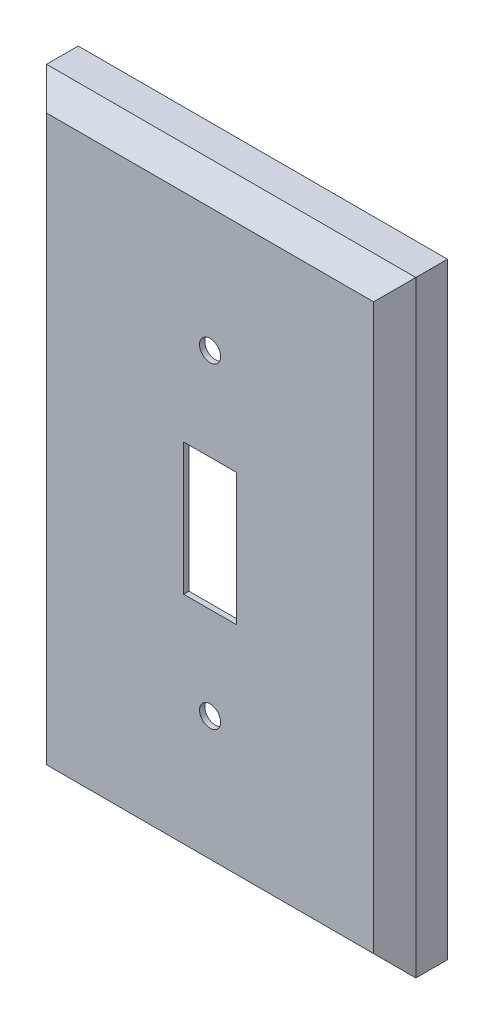
ISO-10303-21;
HEADER;
FILE_DESCRIPTION(('STEP AP214'),'2;1');
FILE_NAME('part.step','',(''),(''),'','','');
FILE_SCHEMA(('AUTOMOTIVE_DESIGN { 1 0 10303 214 1 1 1 1 }'));
ENDSEC;
DATA;
#1=APPLICATION_CONTEXT('core data for automotive mechanical design processes');
#2=APPLICATION_PROTOCOL_DEFINITION('international standard','automotive_design',2000,#1);
#3=PRODUCT_CONTEXT('',#1,'mechanical');
#4=PRODUCT('Part','Part','',(#3));
#5=PRODUCT_RELATED_PRODUCT_CATEGORY('part','',(#4));
#6=PRODUCT_DEFINITION_FORMATION('','',#4);
#7=PRODUCT_DEFINITION_CONTEXT('part definition',#1,'design');
#8=PRODUCT_DEFINITION('design','',#6,#7);
#9=PRODUCT_DEFINITION_SHAPE('','',#8);
#10=(LENGTH_UNIT() NAMED_UNIT(*) SI_UNIT(.MILLI.,.METRE.));
#11=(NAMED_UNIT(*) PLANE_ANGLE_UNIT() SI_UNIT($,.RADIAN.));
#12=(NAMED_UNIT(*) SI_UNIT($,.STERADIAN.) SOLID_ANGLE_UNIT());
#13=UNCERTAINTY_MEASURE_WITH_UNIT(LENGTH_MEASURE(1.E-05),#10,'distance_accuracy_value','');
#14=(GEOMETRIC_REPRESENTATION_CONTEXT(3) GLOBAL_UNCERTAINTY_ASSIGNED_CONTEXT((#13)) GLOBAL_UNIT_ASSIGNED_CONTEXT((#10,
#11,#12)) REPRESENTATION_CONTEXT('',''));
#15=CARTESIAN_POINT('',(0.,0.,0.));
#16=DIRECTION('',(0.,0.,1.));
#17=DIRECTION('',(1.,0.,0.));
#18=AXIS2_PLACEMENT_3D('',#15,#16,#17);
#19=CARTESIAN_POINT('',(0.,115.,0.));
#20=DIRECTION('',(0.,0.,-1.));
#21=DIRECTION('',(-1.,0.,0.));
#22=AXIS2_PLACEMENT_3D('',#19,#20,#21);
#23=PLANE('',#22);
#24=DIRECTION('',(0.,-1.,0.));
#25=VECTOR('',#24,1.);
#26=CARTESIAN_POINT('',(0.,0.,0.));
#27=LINE('',#26,#25);
#28=CARTESIAN_POINT('',(0.,115.,0.));
#29=VERTEX_POINT('',#28);
#30=CARTESIAN_POINT('',(0.,0.,0.));
#31=VERTEX_POINT('',#30);
#32=EDGE_CURVE('E243',#29,#31,#27,.T.);
#33=ORIENTED_EDGE('',*,*,#32,.F.);
#34=DIRECTION('',(-1.,0.,0.));
#35=VECTOR('',#34,1.);
#36=CARTESIAN_POINT('',(0.,115.,0.));
#37=LINE('',#36,#35);
#38=CARTESIAN_POINT('',(70.,115.,0.));
#39=VERTEX_POINT('',#38);
#40=EDGE_CURVE('E252',#39,#29,#37,.T.);
#41=ORIENTED_EDGE('',*,*,#40,.F.);
#42=DIRECTION('',(0.,1.,0.));
#43=VECTOR('',#42,1.);
#44=CARTESIAN_POINT('',(70.,0.,0.));
#45=LINE('',#44,#43);
#46=CARTESIAN_POINT('',(70.,0.,0.));
#47=VERTEX_POINT('',#46);
#48=EDGE_CURVE('E249',#47,#39,#45,.T.);
#49=ORIENTED_EDGE('',*,*,#48,.F.);
#50=DIRECTION('',(1.,0.,0.));
#51=VECTOR('',#50,1.);
#52=CARTESIAN_POINT('',(0.,0.,0.));
#53=LINE('',#52,#51);
#54=EDGE_CURVE('E246',#31,#47,#53,.T.);
#55=ORIENTED_EDGE('',*,*,#54,.F.);
#56=EDGE_LOOP('',(#33,#41,#49,#55));
#57=FACE_BOUND('',#56,.T.);
#58=DIRECTION('',(-1.,0.,0.));
#59=VECTOR('',#58,1.);
#60=CARTESIAN_POINT('',(0.,114.,0.));
#61=LINE('',#60,#59);
#62=CARTESIAN_POINT('',(69.,114.,0.));
#63=VERTEX_POINT('',#62);
#64=CARTESIAN_POINT('',(1.,114.,0.));
#65=VERTEX_POINT('',#64);
#66=EDGE_CURVE('E196',#63,#65,#61,.T.);
#67=ORIENTED_EDGE('',*,*,#66,.T.);
#68=DIRECTION('',(0.,-1.,0.));
#69=VECTOR('',#68,1.);
#70=CARTESIAN_POINT('',(1.,115.,0.));
#71=LINE('',#70,#69);
#72=CARTESIAN_POINT('',(1.,1.,0.));
#73=VERTEX_POINT('',#72);
#74=EDGE_CURVE('E210',#65,#73,#71,.T.);
#75=ORIENTED_EDGE('',*,*,#74,.T.);
#76=DIRECTION('',(1.,0.,0.));
#77=VECTOR('',#76,1.);
#78=CARTESIAN_POINT('',(0.,1.,0.));
#79=LINE('',#78,#77);
#80=CARTESIAN_POINT('',(69.,1.,0.));
#81=VERTEX_POINT('',#80);
#82=EDGE_CURVE('E226',#73,#81,#79,.T.);
#83=ORIENTED_EDGE('',*,*,#82,.T.);
#84=DIRECTION('',(0.,1.,0.));
#85=VECTOR('',#84,1.);
#86=CARTESIAN_POINT('',(69.,115.,0.));
#87=LINE('',#86,#85);
#88=EDGE_CURVE('E229',#81,#63,#87,.T.);
#89=ORIENTED_EDGE('',*,*,#88,.T.);
#90=EDGE_LOOP('',(#67,#75,#83,#89));
#91=FACE_BOUND('',#90,.T.);
#92=ADVANCED_FACE('F42',(#57,#91),#23,.T.);
#93=CARTESIAN_POINT('',(0.,0.,10.));
#94=DIRECTION('',(1.,0.,0.));
#95=DIRECTION('',(0.,0.,-1.));
#96=AXIS2_PLACEMENT_3D('',#93,#94,#95);
#97=PLANE('',#96);
#98=DIRECTION('',(0.,0.,-1.));
#99=VECTOR('',#98,1.);
#100=CARTESIAN_POINT('',(0.,0.,10.));
#101=LINE('',#100,#99);
#102=CARTESIAN_POINT('',(0.,0.,6.));
#103=VERTEX_POINT('',#102);
#104=EDGE_CURVE('E261',#103,#31,#101,.T.);
#105=ORIENTED_EDGE('',*,*,#104,.F.);
#106=DIRECTION('',(0.,1.,0.));
#107=VECTOR('',#106,1.);
#108=CARTESIAN_POINT('',(0.,0.,6.));
#109=LINE('',#108,#107);
#110=CARTESIAN_POINT('',(0.,115.,6.));
#111=VERTEX_POINT('',#110);
#112=EDGE_CURVE('E279',#103,#111,#109,.T.);
#113=ORIENTED_EDGE('',*,*,#112,.T.);
#114=DIRECTION('',(0.,0.,-1.));
#115=VECTOR('',#114,1.);
#116=CARTESIAN_POINT('',(0.,115.,10.));
#117=LINE('',#116,#115);
#118=EDGE_CURVE('E255',#111,#29,#117,.T.);
#119=ORIENTED_EDGE('',*,*,#118,.T.);
#120=ORIENTED_EDGE('',*,*,#32,.T.);
#121=EDGE_LOOP('',(#105,#113,#119,#120));
#122=FACE_BOUND('',#121,.T.);
#123=ADVANCED_FACE('F44',(#122),#97,.F.);
#124=CARTESIAN_POINT('',(0.,0.,10.));
#125=DIRECTION('',(0.,1.,0.));
#126=DIRECTION('',(0.,0.,1.));
#127=AXIS2_PLACEMENT_3D('',#124,#125,#126);
#128=PLANE('',#127);
#129=DIRECTION('',(0.,0.,-1.));
#130=VECTOR('',#129,1.);
#131=CARTESIAN_POINT('',(70.,0.,10.));
#132=LINE('',#131,#130);
#133=CARTESIAN_POINT('',(70.,0.,6.));
#134=VERTEX_POINT('',#133);
#135=EDGE_CURVE('E259',#134,#47,#132,.T.);
#136=ORIENTED_EDGE('',*,*,#135,.F.);
#137=DIRECTION('',(-1.,0.,0.));
#138=VECTOR('',#137,1.);
#139=CARTESIAN_POINT('',(0.,0.,6.));
#140=LINE('',#139,#138);
#141=EDGE_CURVE('E277',#134,#103,#140,.T.);
#142=ORIENTED_EDGE('',*,*,#141,.T.);
#143=ORIENTED_EDGE('',*,*,#104,.T.);
#144=ORIENTED_EDGE('',*,*,#54,.T.);
#145=EDGE_LOOP('',(#136,#142,#143,#144));
#146=FACE_BOUND('',#145,.T.);
#147=ADVANCED_FACE('F322',(#146),#128,.F.);
#148=CARTESIAN_POINT('',(70.,0.,10.));
#149=DIRECTION('',(-1.,0.,0.));
#150=DIRECTION('',(0.,0.,1.));
#151=AXIS2_PLACEMENT_3D('',#148,#149,#150);
#152=PLANE('',#151);
#153=DIRECTION('',(0.,0.,-1.));
#154=VECTOR('',#153,1.);
#155=CARTESIAN_POINT('',(70.,115.,10.));
#156=LINE('',#155,#154);
#157=CARTESIAN_POINT('',(70.,115.,6.));
#158=VERTEX_POINT('',#157);
#159=EDGE_CURVE('E257',#158,#39,#156,.T.);
#160=ORIENTED_EDGE('',*,*,#159,.F.);
#161=DIRECTION('',(0.,-1.,0.));
#162=VECTOR('',#161,1.);
#163=CARTESIAN_POINT('',(70.,0.,6.));
#164=LINE('',#163,#162);
#165=EDGE_CURVE('E275',#158,#134,#164,.T.);
#166=ORIENTED_EDGE('',*,*,#165,.T.);
#167=ORIENTED_EDGE('',*,*,#135,.T.);
#168=ORIENTED_EDGE('',*,*,#48,.T.);
#169=EDGE_LOOP('',(#160,#166,#167,#168));
#170=FACE_BOUND('',#169,.T.);
#171=ADVANCED_FACE('F313',(#170),#152,.F.);
#172=CARTESIAN_POINT('',(0.,115.,10.));
#173=DIRECTION('',(0.,-1.,0.));
#174=DIRECTION('',(0.,0.,-1.));
#175=AXIS2_PLACEMENT_3D('',#172,#173,#174);
#176=PLANE('',#175);
#177=ORIENTED_EDGE('',*,*,#118,.F.);
#178=DIRECTION('',(1.,0.,0.));
#179=VECTOR('',#178,1.);
#180=CARTESIAN_POINT('',(0.,115.,6.));
#181=LINE('',#180,#179);
#182=EDGE_CURVE('E272',#111,#158,#181,.T.);
#183=ORIENTED_EDGE('',*,*,#182,.T.);
#184=ORIENTED_EDGE('',*,*,#159,.T.);
#185=ORIENTED_EDGE('',*,*,#40,.T.);
#186=EDGE_LOOP('',(#177,#183,#184,#185));
#187=FACE_BOUND('',#186,.T.);
#188=ADVANCED_FACE('F304',(#187),#176,.F.);
#189=CARTESIAN_POINT('',(0.,115.,10.));
#190=DIRECTION('',(0.,0.,-1.));
#191=DIRECTION('',(-1.,0.,0.));
#192=AXIS2_PLACEMENT_3D('',#189,#190,#191);
#193=PLANE('',#192);
#194=CARTESIAN_POINT('',(35.,27.5,10.));
#195=DIRECTION('',(0.,0.,1.));
#196=DIRECTION('',(-1.,0.,0.));
#197=AXIS2_PLACEMENT_3D('',#194,#195,#196);
#198=CIRCLE('',#197,2.);
#199=CARTESIAN_POINT('',(33.,27.5,10.));
#200=VERTEX_POINT('',#199);
#201=EDGE_CURVE('E294',#200,#200,#198,.T.);
#202=ORIENTED_EDGE('',*,*,#201,.F.);
#203=EDGE_LOOP('',(#202));
#204=FACE_BOUND('',#203,.T.);
#205=CARTESIAN_POINT('',(35.,87.5,10.));
#206=DIRECTION('',(0.,0.,1.));
#207=DIRECTION('',(1.,0.,0.));
#208=AXIS2_PLACEMENT_3D('',#205,#206,#207);
#209=CIRCLE('',#208,2.);
#210=CARTESIAN_POINT('',(37.,87.5,10.));
#211=VERTEX_POINT('',#210);
#212=EDGE_CURVE('E286',#211,#211,#209,.T.);
#213=ORIENTED_EDGE('',*,*,#212,.F.);
#214=EDGE_LOOP('',(#213));
#215=FACE_BOUND('',#214,.T.);
#216=DIRECTION('',(1.,0.,0.));
#217=VECTOR('',#216,1.);
#218=CARTESIAN_POINT('',(30.,45.,10.));
#219=LINE('',#218,#217);
#220=CARTESIAN_POINT('',(30.,45.,10.));
#221=VERTEX_POINT('',#220);
#222=CARTESIAN_POINT('',(40.,45.,10.));
#223=VERTEX_POINT('',#222);
#224=EDGE_CURVE('E168',#221,#223,#219,.T.);
#225=ORIENTED_EDGE('',*,*,#224,.F.);
#226=DIRECTION('',(0.,-1.,0.));
#227=VECTOR('',#226,1.);
#228=CARTESIAN_POINT('',(30.,70.,10.));
#229=LINE('',#228,#227);
#230=CARTESIAN_POINT('',(30.,70.,10.));
#231=VERTEX_POINT('',#230);
#232=EDGE_CURVE('E59',#231,#221,#229,.T.);
#233=ORIENTED_EDGE('',*,*,#232,.F.);
#234=DIRECTION('',(-1.,0.,0.));
#235=VECTOR('',#234,1.);
#236=CARTESIAN_POINT('',(30.,70.,10.));
#237=LINE('',#236,#235);
#238=CARTESIAN_POINT('',(40.,70.,10.));
#239=VERTEX_POINT('',#238);
#240=EDGE_CURVE('E175',#239,#231,#237,.T.);
#241=ORIENTED_EDGE('',*,*,#240,.F.);
#242=DIRECTION('',(0.,1.,0.));
#243=VECTOR('',#242,1.);
#244=CARTESIAN_POINT('',(40.,70.,10.));
#245=LINE('',#244,#243);
#246=EDGE_CURVE('E159',#223,#239,#245,.T.);
#247=ORIENTED_EDGE('',*,*,#246,.F.);
#248=EDGE_LOOP('',(#225,#233,#241,#247));
#249=FACE_BOUND('',#248,.T.);
#250=DIRECTION('',(0.,1.,0.));
#251=VECTOR('',#250,1.);
#252=CARTESIAN_POINT('',(66.,115.,10.));
#253=LINE('',#252,#251);
#254=CARTESIAN_POINT('',(66.,4.,10.));
#255=VERTEX_POINT('',#254);
#256=CARTESIAN_POINT('',(66.,111.,10.));
#257=VERTEX_POINT('',#256);
#258=EDGE_CURVE('E267',#255,#257,#253,.T.);
#259=ORIENTED_EDGE('',*,*,#258,.T.);
#260=DIRECTION('',(-1.,0.,0.));
#261=VECTOR('',#260,1.);
#262=CARTESIAN_POINT('',(0.,111.,10.));
#263=LINE('',#262,#261);
#264=CARTESIAN_POINT('',(4.,111.,10.));
#265=VERTEX_POINT('',#264);
#266=EDGE_CURVE('E269',#257,#265,#263,.T.);
#267=ORIENTED_EDGE('',*,*,#266,.T.);
#268=DIRECTION('',(0.,-1.,0.));
#269=VECTOR('',#268,1.);
#270=CARTESIAN_POINT('',(4.,115.,10.));
#271=LINE('',#270,#269);
#272=CARTESIAN_POINT('',(4.,4.,10.));
#273=VERTEX_POINT('',#272);
#274=EDGE_CURVE('E263',#265,#273,#271,.T.);
#275=ORIENTED_EDGE('',*,*,#274,.T.);
#276=DIRECTION('',(1.,0.,0.));
#277=VECTOR('',#276,1.);
#278=CARTESIAN_POINT('',(0.,4.,10.));
#279=LINE('',#278,#277);
#280=EDGE_CURVE('E265',#273,#255,#279,.T.);
#281=ORIENTED_EDGE('',*,*,#280,.T.);
#282=EDGE_LOOP('',(#259,#267,#275,#281));
#283=FACE_BOUND('',#282,.T.);
#284=ADVANCED_FACE('F172',(#204,#215,#249,#283),#193,.F.);
#285=CARTESIAN_POINT('',(0.,4.,10.));
#286=DIRECTION('',(0.,0.707106781186547,-0.707106781186547));
#287=DIRECTION('',(0.,0.707106781186548,0.707106781186548));
#288=AXIS2_PLACEMENT_3D('',#285,#286,#287);
#289=PLANE('',#288);
#290=DIRECTION('',(0.577350269189626,0.577350269189626,0.577350269189626));
#291=VECTOR('',#290,1.);
#292=CARTESIAN_POINT('',(41.,41.,47.));
#293=LINE('',#292,#291);
#294=EDGE_CURVE('E237',#103,#273,#293,.T.);
#295=ORIENTED_EDGE('',*,*,#294,.F.);
#296=ORIENTED_EDGE('',*,*,#141,.F.);
#297=DIRECTION('',(-0.577350269189626,0.577350269189626,0.577350269189626));
#298=VECTOR('',#297,1.);
#299=CARTESIAN_POINT('',(44.,26.,32.));
#300=LINE('',#299,#298);
#301=EDGE_CURVE('E240',#255,#134,#300,.F.);
#302=ORIENTED_EDGE('',*,*,#301,.F.);
#303=ORIENTED_EDGE('',*,*,#280,.F.);
#304=EDGE_LOOP('',(#295,#296,#302,#303));
#305=FACE_BOUND('',#304,.T.);
#306=ADVANCED_FACE('F303',(#305),#289,.F.);
#307=CARTESIAN_POINT('',(66.,115.,10.));
#308=DIRECTION('',(-0.707106781186547,0.,-0.707106781186547));
#309=DIRECTION('',(-0.707106781186548,0.,0.707106781186548));
#310=AXIS2_PLACEMENT_3D('',#307,#308,#309);
#311=PLANE('',#310);
#312=ORIENTED_EDGE('',*,*,#301,.T.);
#313=ORIENTED_EDGE('',*,*,#165,.F.);
#314=DIRECTION('',(-0.577350269189626,-0.577350269189626,0.577350269189626));
#315=VECTOR('',#314,1.);
#316=CARTESIAN_POINT('',(67.3333333333333,112.333333333333,8.66666666666667));
#317=LINE('',#316,#315);
#318=EDGE_CURVE('E235',#257,#158,#317,.F.);
#319=ORIENTED_EDGE('',*,*,#318,.F.);
#320=ORIENTED_EDGE('',*,*,#258,.F.);
#321=EDGE_LOOP('',(#312,#313,#319,#320));
#322=FACE_BOUND('',#321,.T.);
#323=ADVANCED_FACE('F310',(#322),#311,.F.);
#324=CARTESIAN_POINT('',(4.,115.,10.));
#325=DIRECTION('',(0.707106781186547,0.,-0.707106781186547));
#326=DIRECTION('',(-0.707106781186548,0.,-0.707106781186548));
#327=AXIS2_PLACEMENT_3D('',#324,#325,#326);
#328=PLANE('',#327);
#329=ORIENTED_EDGE('',*,*,#294,.T.);
#330=ORIENTED_EDGE('',*,*,#274,.F.);
#331=DIRECTION('',(-0.577350269189626,0.577350269189626,-0.577350269189626));
#332=VECTOR('',#331,1.);
#333=CARTESIAN_POINT('',(2.66666666666667,112.333333333333,8.66666666666667));
#334=LINE('',#333,#332);
#335=EDGE_CURVE('E191',#111,#265,#334,.F.);
#336=ORIENTED_EDGE('',*,*,#335,.F.);
#337=ORIENTED_EDGE('',*,*,#112,.F.);
#338=EDGE_LOOP('',(#329,#330,#336,#337));
#339=FACE_BOUND('',#338,.T.);
#340=ADVANCED_FACE('F329',(#339),#328,.F.);
#341=CARTESIAN_POINT('',(0.,111.,10.));
#342=DIRECTION('',(0.,-0.707106781186547,-0.707106781186547));
#343=DIRECTION('',(0.,0.707106781186548,-0.707106781186548));
#344=AXIS2_PLACEMENT_3D('',#341,#342,#343);
#345=PLANE('',#344);
#346=ORIENTED_EDGE('',*,*,#318,.T.);
#347=ORIENTED_EDGE('',*,*,#182,.F.);
#348=ORIENTED_EDGE('',*,*,#335,.T.);
#349=ORIENTED_EDGE('',*,*,#266,.F.);
#350=EDGE_LOOP('',(#346,#347,#348,#349));
#351=FACE_BOUND('',#350,.T.);
#352=ADVANCED_FACE('F333',(#351),#345,.F.);
#353=CARTESIAN_POINT('',(1.,0.,10.));
#354=DIRECTION('',(1.,0.,0.));
#355=DIRECTION('',(0.,0.,-1.));
#356=AXIS2_PLACEMENT_3D('',#353,#354,#355);
#357=PLANE('',#356);
#358=DIRECTION('',(0.,0.,-1.));
#359=VECTOR('',#358,1.);
#360=CARTESIAN_POINT('',(1.,1.,10.));
#361=LINE('',#360,#359);
#362=CARTESIAN_POINT('',(1.,0.999999999999994,5.58578643762691));
#363=VERTEX_POINT('',#362);
#364=EDGE_CURVE('E185',#363,#73,#361,.T.);
#365=ORIENTED_EDGE('',*,*,#364,.T.);
#366=ORIENTED_EDGE('',*,*,#74,.F.);
#367=DIRECTION('',(0.,0.,-1.));
#368=VECTOR('',#367,1.);
#369=CARTESIAN_POINT('',(1.,114.,10.));
#370=LINE('',#369,#368);
#371=CARTESIAN_POINT('',(1.,114.,5.5857864376269));
#372=VERTEX_POINT('',#371);
#373=EDGE_CURVE('E193',#372,#65,#370,.T.);
#374=ORIENTED_EDGE('',*,*,#373,.F.);
#375=DIRECTION('',(0.,-1.,0.));
#376=VECTOR('',#375,1.);
#377=CARTESIAN_POINT('',(1.,115.,5.5857864376269));
#378=LINE('',#377,#376);
#379=EDGE_CURVE('E189',#363,#372,#378,.F.);
#380=ORIENTED_EDGE('',*,*,#379,.F.);
#381=EDGE_LOOP('',(#365,#366,#374,#380));
#382=FACE_BOUND('',#381,.T.);
#383=ADVANCED_FACE('F337',(#382),#357,.T.);
#384=CARTESIAN_POINT('',(0.,1.,10.));
#385=DIRECTION('',(0.,1.,0.));
#386=DIRECTION('',(0.,0.,1.));
#387=AXIS2_PLACEMENT_3D('',#384,#385,#386);
#388=PLANE('',#387);
#389=DIRECTION('',(0.,0.,-1.));
#390=VECTOR('',#389,1.);
#391=CARTESIAN_POINT('',(69.,1.,10.));
#392=LINE('',#391,#390);
#393=CARTESIAN_POINT('',(69.,0.999999999999994,5.5857864376269));
#394=VERTEX_POINT('',#393);
#395=EDGE_CURVE('E188',#394,#81,#392,.T.);
#396=ORIENTED_EDGE('',*,*,#395,.T.);
#397=ORIENTED_EDGE('',*,*,#82,.F.);
#398=ORIENTED_EDGE('',*,*,#364,.F.);
#399=DIRECTION('',(1.,0.,0.));
#400=VECTOR('',#399,1.);
#401=CARTESIAN_POINT('',(0.,1.,5.5857864376269));
#402=LINE('',#401,#400);
#403=EDGE_CURVE('E192',#394,#363,#402,.F.);
#404=ORIENTED_EDGE('',*,*,#403,.F.);
#405=EDGE_LOOP('',(#396,#397,#398,#404));
#406=FACE_BOUND('',#405,.T.);
#407=ADVANCED_FACE('F367',(#406),#388,.T.);
#408=CARTESIAN_POINT('',(69.,0.,10.));
#409=DIRECTION('',(-1.,0.,0.));
#410=DIRECTION('',(0.,0.,1.));
#411=AXIS2_PLACEMENT_3D('',#408,#409,#410);
#412=PLANE('',#411);
#413=DIRECTION('',(0.,0.,-1.));
#414=VECTOR('',#413,1.);
#415=CARTESIAN_POINT('',(69.,114.,10.));
#416=LINE('',#415,#414);
#417=CARTESIAN_POINT('',(69.,114.,5.5857864376269));
#418=VERTEX_POINT('',#417);
#419=EDGE_CURVE('E195',#418,#63,#416,.T.);
#420=ORIENTED_EDGE('',*,*,#419,.T.);
#421=ORIENTED_EDGE('',*,*,#88,.F.);
#422=ORIENTED_EDGE('',*,*,#395,.F.);
#423=DIRECTION('',(0.,1.,0.));
#424=VECTOR('',#423,1.);
#425=CARTESIAN_POINT('',(69.,115.,5.58578643762691));
#426=LINE('',#425,#424);
#427=EDGE_CURVE('E200',#418,#394,#426,.F.);
#428=ORIENTED_EDGE('',*,*,#427,.F.);
#429=EDGE_LOOP('',(#420,#421,#422,#428));
#430=FACE_BOUND('',#429,.T.);
#431=ADVANCED_FACE('F363',(#430),#412,.T.);
#432=CARTESIAN_POINT('',(0.,114.,10.));
#433=DIRECTION('',(0.,-1.,0.));
#434=DIRECTION('',(0.,0.,-1.));
#435=AXIS2_PLACEMENT_3D('',#432,#433,#434);
#436=PLANE('',#435);
#437=ORIENTED_EDGE('',*,*,#373,.T.);
#438=ORIENTED_EDGE('',*,*,#66,.F.);
#439=ORIENTED_EDGE('',*,*,#419,.F.);
#440=DIRECTION('',(-1.,0.,0.));
#441=VECTOR('',#440,1.);
#442=CARTESIAN_POINT('',(0.,114.,5.58578643762691));
#443=LINE('',#442,#441);
#444=EDGE_CURVE('E203',#372,#418,#443,.F.);
#445=ORIENTED_EDGE('',*,*,#444,.F.);
#446=EDGE_LOOP('',(#437,#438,#439,#445));
#447=FACE_BOUND('',#446,.T.);
#448=ADVANCED_FACE('F359',(#447),#436,.T.);
#449=CARTESIAN_POINT('',(0.,115.,9.));
#450=DIRECTION('',(0.,0.,-1.));
#451=DIRECTION('',(-1.,0.,0.));
#452=AXIS2_PLACEMENT_3D('',#449,#450,#451);
#453=PLANE('',#452);
#454=CARTESIAN_POINT('',(35.,27.5,9.));
#455=DIRECTION('',(0.,0.,-1.));
#456=DIRECTION('',(-1.,0.,0.));
#457=AXIS2_PLACEMENT_3D('',#454,#455,#456);
#458=CIRCLE('',#457,2.);
#459=CARTESIAN_POINT('',(33.,27.5,9.));
#460=VERTEX_POINT('',#459);
#461=EDGE_CURVE('E46',#460,#460,#458,.T.);
#462=ORIENTED_EDGE('',*,*,#461,.F.);
#463=EDGE_LOOP('',(#462));
#464=FACE_BOUND('',#463,.T.);
#465=CARTESIAN_POINT('',(35.,87.5,9.));
#466=DIRECTION('',(0.,0.,-1.));
#467=DIRECTION('',(-1.,0.,0.));
#468=AXIS2_PLACEMENT_3D('',#465,#466,#467);
#469=CIRCLE('',#468,2.);
#470=CARTESIAN_POINT('',(33.,87.5,9.));
#471=VERTEX_POINT('',#470);
#472=EDGE_CURVE('E284',#471,#471,#469,.T.);
#473=ORIENTED_EDGE('',*,*,#472,.F.);
#474=EDGE_LOOP('',(#473));
#475=FACE_BOUND('',#474,.T.);
#476=DIRECTION('',(0.,1.,0.));
#477=VECTOR('',#476,1.);
#478=CARTESIAN_POINT('',(30.,115.,9.));
#479=LINE('',#478,#477);
#480=CARTESIAN_POINT('',(30.,45.,9.));
#481=VERTEX_POINT('',#480);
#482=CARTESIAN_POINT('',(30.,70.,9.));
#483=VERTEX_POINT('',#482);
#484=EDGE_CURVE('E13',#481,#483,#479,.T.);
#485=ORIENTED_EDGE('',*,*,#484,.F.);
#486=DIRECTION('',(-1.,0.,0.));
#487=VECTOR('',#486,1.);
#488=CARTESIAN_POINT('',(0.,45.,9.));
#489=LINE('',#488,#487);
#490=CARTESIAN_POINT('',(40.,45.,9.));
#491=VERTEX_POINT('',#490);
#492=EDGE_CURVE('E281',#491,#481,#489,.T.);
#493=ORIENTED_EDGE('',*,*,#492,.F.);
#494=DIRECTION('',(0.,-1.,0.));
#495=VECTOR('',#494,1.);
#496=CARTESIAN_POINT('',(40.,115.,9.));
#497=LINE('',#496,#495);
#498=CARTESIAN_POINT('',(40.,70.,9.));
#499=VERTEX_POINT('',#498);
#500=EDGE_CURVE('E162',#499,#491,#497,.T.);
#501=ORIENTED_EDGE('',*,*,#500,.F.);
#502=DIRECTION('',(1.,0.,0.));
#503=VECTOR('',#502,1.);
#504=CARTESIAN_POINT('',(0.,70.,9.));
#505=LINE('',#504,#503);
#506=EDGE_CURVE('E51',#483,#499,#505,.T.);
#507=ORIENTED_EDGE('',*,*,#506,.F.);
#508=EDGE_LOOP('',(#485,#493,#501,#507));
#509=FACE_BOUND('',#508,.T.);
#510=DIRECTION('',(0.,-1.,0.));
#511=VECTOR('',#510,1.);
#512=CARTESIAN_POINT('',(65.5857864376269,115.,9.));
#513=LINE('',#512,#511);
#514=CARTESIAN_POINT('',(65.5857864376269,4.4142135623731,9.));
#515=VERTEX_POINT('',#514);
#516=CARTESIAN_POINT('',(65.5857864376269,110.585786437627,9.));
#517=VERTEX_POINT('',#516);
#518=EDGE_CURVE('E214',#515,#517,#513,.F.);
#519=ORIENTED_EDGE('',*,*,#518,.F.);
#520=DIRECTION('',(-1.,0.,0.));
#521=VECTOR('',#520,1.);
#522=CARTESIAN_POINT('',(0.,4.4142135623731,9.));
#523=LINE('',#522,#521);
#524=CARTESIAN_POINT('',(4.4142135623731,4.4142135623731,9.));
#525=VERTEX_POINT('',#524);
#526=EDGE_CURVE('E216',#525,#515,#523,.F.);
#527=ORIENTED_EDGE('',*,*,#526,.F.);
#528=DIRECTION('',(0.,1.,0.));
#529=VECTOR('',#528,1.);
#530=CARTESIAN_POINT('',(4.4142135623731,115.,9.));
#531=LINE('',#530,#529);
#532=CARTESIAN_POINT('',(4.4142135623731,110.585786437627,9.));
#533=VERTEX_POINT('',#532);
#534=EDGE_CURVE('E187',#533,#525,#531,.F.);
#535=ORIENTED_EDGE('',*,*,#534,.F.);
#536=DIRECTION('',(1.,0.,0.));
#537=VECTOR('',#536,1.);
#538=CARTESIAN_POINT('',(0.,110.585786437627,9.));
#539=LINE('',#538,#537);
#540=EDGE_CURVE('E206',#517,#533,#539,.F.);
#541=ORIENTED_EDGE('',*,*,#540,.F.);
#542=EDGE_LOOP('',(#519,#527,#535,#541));
#543=FACE_BOUND('',#542,.T.);
#544=ADVANCED_FACE('F355',(#464,#475,#509,#543),#453,.T.);
#545=CARTESIAN_POINT('',(0.,4.70710678118655,9.29289321881345));
#546=DIRECTION('',(0.,0.707106781186547,-0.707106781186547));
#547=DIRECTION('',(0.,0.707106781186548,0.707106781186548));
#548=AXIS2_PLACEMENT_3D('',#545,#546,#547);
#549=PLANE('',#548);
#550=DIRECTION('',(0.577350269189626,0.577350269189626,0.577350269189626));
#551=VECTOR('',#550,1.);
#552=CARTESIAN_POINT('',(41.471404520791,41.471404520791,46.0571909584179));
#553=LINE('',#552,#551);
#554=EDGE_CURVE('E211',#363,#525,#553,.T.);
#555=ORIENTED_EDGE('',*,*,#554,.T.);
#556=ORIENTED_EDGE('',*,*,#526,.T.);
#557=DIRECTION('',(0.577350269189626,-0.577350269189626,-0.577350269189626));
#558=VECTOR('',#557,1.);
#559=CARTESIAN_POINT('',(28.528595479209,41.471404520791,46.0571909584179));
#560=LINE('',#559,#558);
#561=EDGE_CURVE('E207',#515,#394,#560,.T.);
#562=ORIENTED_EDGE('',*,*,#561,.T.);
#563=ORIENTED_EDGE('',*,*,#403,.T.);
#564=EDGE_LOOP('',(#555,#556,#562,#563));
#565=FACE_BOUND('',#564,.T.);
#566=ADVANCED_FACE('F351',(#565),#549,.T.);
#567=CARTESIAN_POINT('',(65.2928932188135,115.,9.29289321881345));
#568=DIRECTION('',(-0.707106781186547,0.,-0.707106781186547));
#569=DIRECTION('',(-0.707106781186548,0.,0.707106781186548));
#570=AXIS2_PLACEMENT_3D('',#567,#568,#569);
#571=PLANE('',#570);
#572=ORIENTED_EDGE('',*,*,#561,.F.);
#573=ORIENTED_EDGE('',*,*,#518,.T.);
#574=DIRECTION('',(0.577350269189626,0.577350269189626,-0.577350269189626));
#575=VECTOR('',#574,1.);
#576=CARTESIAN_POINT('',(43.528595479209,88.528595479209,31.0571909584179));
#577=LINE('',#576,#575);
#578=EDGE_CURVE('E212',#517,#418,#577,.T.);
#579=ORIENTED_EDGE('',*,*,#578,.T.);
#580=ORIENTED_EDGE('',*,*,#427,.T.);
#581=EDGE_LOOP('',(#572,#573,#579,#580));
#582=FACE_BOUND('',#581,.T.);
#583=ADVANCED_FACE('F347',(#582),#571,.T.);
#584=CARTESIAN_POINT('',(4.70710678118655,115.,9.29289321881345));
#585=DIRECTION('',(0.707106781186547,0.,-0.707106781186547));
#586=DIRECTION('',(-0.707106781186548,0.,-0.707106781186548));
#587=AXIS2_PLACEMENT_3D('',#584,#585,#586);
#588=PLANE('',#587);
#589=ORIENTED_EDGE('',*,*,#554,.F.);
#590=ORIENTED_EDGE('',*,*,#379,.T.);
#591=DIRECTION('',(0.577350269189626,-0.577350269189626,0.577350269189626));
#592=VECTOR('',#591,1.);
#593=CARTESIAN_POINT('',(3.1380711874577,111.861928812542,7.7238576250846));
#594=LINE('',#593,#592);
#595=EDGE_CURVE('E182',#372,#533,#594,.T.);
#596=ORIENTED_EDGE('',*,*,#595,.T.);
#597=ORIENTED_EDGE('',*,*,#534,.T.);
#598=EDGE_LOOP('',(#589,#590,#596,#597));
#599=FACE_BOUND('',#598,.T.);
#600=ADVANCED_FACE('F343',(#599),#588,.T.);
#601=CARTESIAN_POINT('',(0.,110.292893218813,9.29289321881345));
#602=DIRECTION('',(0.,-0.707106781186547,-0.707106781186547));
#603=DIRECTION('',(0.,0.707106781186548,-0.707106781186548));
#604=AXIS2_PLACEMENT_3D('',#601,#602,#603);
#605=PLANE('',#604);
#606=ORIENTED_EDGE('',*,*,#578,.F.);
#607=ORIENTED_EDGE('',*,*,#540,.T.);
#608=ORIENTED_EDGE('',*,*,#595,.F.);
#609=ORIENTED_EDGE('',*,*,#444,.T.);
#610=EDGE_LOOP('',(#606,#607,#608,#609));
#611=FACE_BOUND('',#610,.T.);
#612=ADVANCED_FACE('F339',(#611),#605,.T.);
#613=CARTESIAN_POINT('',(30.,70.,0.));
#614=DIRECTION('',(-1.,0.,0.));
#615=DIRECTION('',(0.,-1.,0.));
#616=AXIS2_PLACEMENT_3D('',#613,#614,#615);
#617=PLANE('',#616);
#618=ORIENTED_EDGE('',*,*,#484,.T.);
#619=DIRECTION('',(0.,0.,1.));
#620=VECTOR('',#619,1.);
#621=CARTESIAN_POINT('',(30.,70.,0.));
#622=LINE('',#621,#620);
#623=EDGE_CURVE('E180',#483,#231,#622,.T.);
#624=ORIENTED_EDGE('',*,*,#623,.T.);
#625=ORIENTED_EDGE('',*,*,#232,.T.);
#626=DIRECTION('',(0.,0.,1.));
#627=VECTOR('',#626,1.);
#628=CARTESIAN_POINT('',(30.,45.,0.));
#629=LINE('',#628,#627);
#630=EDGE_CURVE('E165',#481,#221,#629,.T.);
#631=ORIENTED_EDGE('',*,*,#630,.F.);
#632=EDGE_LOOP('',(#618,#624,#625,#631));
#633=FACE_BOUND('',#632,.T.);
#634=ADVANCED_FACE('F342',(#633),#617,.F.);
#635=CARTESIAN_POINT('',(30.,70.,0.));
#636=DIRECTION('',(0.,1.,0.));
#637=DIRECTION('',(0.,0.,1.));
#638=AXIS2_PLACEMENT_3D('',#635,#636,#637);
#639=PLANE('',#638);
#640=ORIENTED_EDGE('',*,*,#506,.T.);
#641=DIRECTION('',(0.,0.,1.));
#642=VECTOR('',#641,1.);
#643=CARTESIAN_POINT('',(40.,70.,0.));
#644=LINE('',#643,#642);
#645=EDGE_CURVE('E164',#499,#239,#644,.T.);
#646=ORIENTED_EDGE('',*,*,#645,.T.);
#647=ORIENTED_EDGE('',*,*,#240,.T.);
#648=ORIENTED_EDGE('',*,*,#623,.F.);
#649=EDGE_LOOP('',(#640,#646,#647,#648));
#650=FACE_BOUND('',#649,.T.);
#651=ADVANCED_FACE('F377',(#650),#639,.F.);
#652=CARTESIAN_POINT('',(40.,70.,0.));
#653=DIRECTION('',(1.,0.,0.));
#654=DIRECTION('',(0.,1.,0.));
#655=AXIS2_PLACEMENT_3D('',#652,#653,#654);
#656=PLANE('',#655);
#657=ORIENTED_EDGE('',*,*,#500,.T.);
#658=DIRECTION('',(0.,0.,1.));
#659=VECTOR('',#658,1.);
#660=CARTESIAN_POINT('',(40.,45.,0.));
#661=LINE('',#660,#659);
#662=EDGE_CURVE('E67',#491,#223,#661,.T.);
#663=ORIENTED_EDGE('',*,*,#662,.T.);
#664=ORIENTED_EDGE('',*,*,#246,.T.);
#665=ORIENTED_EDGE('',*,*,#645,.F.);
#666=EDGE_LOOP('',(#657,#663,#664,#665));
#667=FACE_BOUND('',#666,.T.);
#668=ADVANCED_FACE('F156',(#667),#656,.F.);
#669=CARTESIAN_POINT('',(30.,45.,0.));
#670=DIRECTION('',(0.,-1.,0.));
#671=DIRECTION('',(1.,0.,0.));
#672=AXIS2_PLACEMENT_3D('',#669,#670,#671);
#673=PLANE('',#672);
#674=ORIENTED_EDGE('',*,*,#492,.T.);
#675=ORIENTED_EDGE('',*,*,#630,.T.);
#676=ORIENTED_EDGE('',*,*,#224,.T.);
#677=ORIENTED_EDGE('',*,*,#662,.F.);
#678=EDGE_LOOP('',(#674,#675,#676,#677));
#679=FACE_BOUND('',#678,.T.);
#680=ADVANCED_FACE('F169',(#679),#673,.F.);
#681=CARTESIAN_POINT('',(35.,87.5,0.));
#682=DIRECTION('',(0.,0.,1.));
#683=DIRECTION('',(1.,0.,0.));
#684=AXIS2_PLACEMENT_3D('',#681,#682,#683);
#685=CYLINDRICAL_SURFACE('',#684,2.);
#686=ORIENTED_EDGE('',*,*,#472,.T.);
#687=EDGE_LOOP('',(#686));
#688=FACE_BOUND('',#687,.T.);
#689=ORIENTED_EDGE('',*,*,#212,.T.);
#690=EDGE_LOOP('',(#689));
#691=FACE_BOUND('',#690,.T.);
#692=ADVANCED_FACE('F380',(#688,#691),#685,.F.);
#693=CARTESIAN_POINT('',(35.,27.5,0.));
#694=DIRECTION('',(0.,0.,1.));
#695=DIRECTION('',(1.,0.,0.));
#696=AXIS2_PLACEMENT_3D('',#693,#694,#695);
#697=CYLINDRICAL_SURFACE('',#696,2.);
#698=ORIENTED_EDGE('',*,*,#461,.T.);
#699=EDGE_LOOP('',(#698));
#700=FACE_BOUND('',#699,.T.);
#701=ORIENTED_EDGE('',*,*,#201,.T.);
#702=EDGE_LOOP('',(#701));
#703=FACE_BOUND('',#702,.T.);
#704=ADVANCED_FACE('F299',(#700,#703),#697,.F.);
#705=CLOSED_SHELL('',(#92,#123,#147,#171,#188,#284,#306,#323,#340,#352,#383,#407,#431,#448,#544,
#566,#583,#600,#612,#634,#651,#668,#680,#692,#704));
#706=MANIFOLD_SOLID_BREP('B2',#705);
#707=ADVANCED_BREP_SHAPE_REPRESENTATION('',(#18,#706),#14);
#708=SHAPE_DEFINITION_REPRESENTATION(#9,#707);
ENDSEC;
END-ISO-10303-21;
